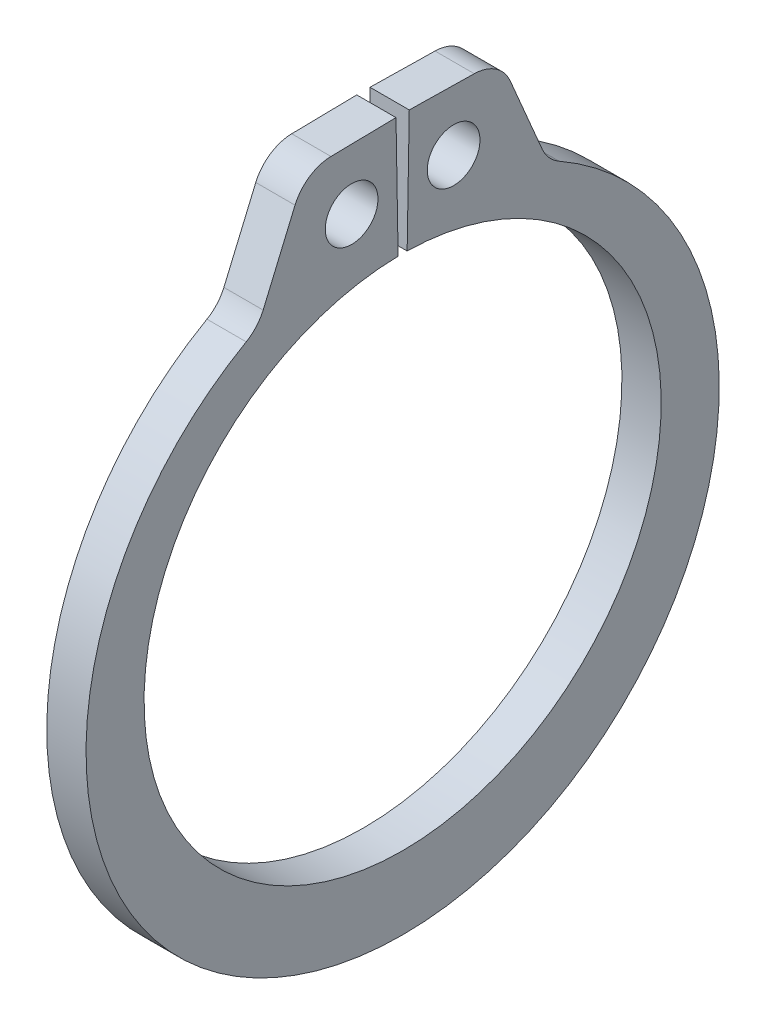
ISO-10303-21;
HEADER;
FILE_DESCRIPTION(('STEP AP214'),'2;1');
FILE_NAME('part.step','',(''),(''),'','','');
FILE_SCHEMA(('AUTOMOTIVE_DESIGN { 1 0 10303 214 1 1 1 1 }'));
ENDSEC;
DATA;
#1=APPLICATION_CONTEXT('core data for automotive mechanical design processes');
#2=APPLICATION_PROTOCOL_DEFINITION('international standard','automotive_design',2000,#1);
#3=PRODUCT_CONTEXT('',#1,'mechanical');
#4=PRODUCT('Part','Part','',(#3));
#5=PRODUCT_RELATED_PRODUCT_CATEGORY('part','',(#4));
#6=PRODUCT_DEFINITION_FORMATION('','',#4);
#7=PRODUCT_DEFINITION_CONTEXT('part definition',#1,'design');
#8=PRODUCT_DEFINITION('design','',#6,#7);
#9=PRODUCT_DEFINITION_SHAPE('','',#8);
#10=(LENGTH_UNIT() NAMED_UNIT(*) SI_UNIT(.MILLI.,.METRE.));
#11=(NAMED_UNIT(*) PLANE_ANGLE_UNIT() SI_UNIT($,.RADIAN.));
#12=(NAMED_UNIT(*) SI_UNIT($,.STERADIAN.) SOLID_ANGLE_UNIT());
#13=UNCERTAINTY_MEASURE_WITH_UNIT(LENGTH_MEASURE(1.E-05),#10,'distance_accuracy_value','');
#14=(GEOMETRIC_REPRESENTATION_CONTEXT(3) GLOBAL_UNCERTAINTY_ASSIGNED_CONTEXT((#13)) GLOBAL_UNIT_ASSIGNED_CONTEXT((#10,
#11,#12)) REPRESENTATION_CONTEXT('',''));
#15=CARTESIAN_POINT('',(0.,0.,0.));
#16=DIRECTION('',(0.,0.,1.));
#17=DIRECTION('',(1.,0.,0.));
#18=AXIS2_PLACEMENT_3D('',#15,#16,#17);
#19=CARTESIAN_POINT('',(-0.4445,0.,0.));
#20=DIRECTION('',(1.,0.,0.));
#21=DIRECTION('',(0.,0.,-1.));
#22=AXIS2_PLACEMENT_3D('',#19,#20,#21);
#23=PLANE('',#22);
#24=CARTESIAN_POINT('',(-0.4445,7.20724610900659,-1.15465964864512));
#25=DIRECTION('',(-1.,0.,0.));
#26=DIRECTION('',(0.,0.,1.));
#27=AXIS2_PLACEMENT_3D('',#24,#25,#26);
#28=CIRCLE('',#27,0.5969);
#29=CARTESIAN_POINT('',(-0.4445,7.20724610900659,-0.557759648645122));
#30=VERTEX_POINT('',#29);
#31=EDGE_CURVE('E177',#30,#30,#28,.F.);
#32=ORIENTED_EDGE('',*,*,#31,.T.);
#33=EDGE_LOOP('',(#32));
#34=FACE_BOUND('',#33,.T.);
#35=CARTESIAN_POINT('',(-0.4445,7.20724610900659,1.15465964864512));
#36=DIRECTION('',(-1.,0.,0.));
#37=DIRECTION('',(0.,0.,1.));
#38=AXIS2_PLACEMENT_3D('',#35,#36,#37);
#39=CIRCLE('',#38,0.5969);
#40=CARTESIAN_POINT('',(-0.4445,7.20724610900659,1.75155964864512));
#41=VERTEX_POINT('',#40);
#42=EDGE_CURVE('E129',#41,#41,#39,.F.);
#43=ORIENTED_EDGE('',*,*,#42,.T.);
#44=EDGE_LOOP('',(#43));
#45=FACE_BOUND('',#44,.T.);
#46=CARTESIAN_POINT('',(-0.4445,7.66933071962559,1.60650376158788));
#47=DIRECTION('',(-1.,0.,0.));
#48=DIRECTION('',(0.,0.,1.));
#49=AXIS2_PLACEMENT_3D('',#46,#47,#48);
#50=CIRCLE('',#49,0.9017);
#51=CARTESIAN_POINT('',(-0.4445,8.57089338634811,1.62224059647239));
#52=VERTEX_POINT('',#51);
#53=CARTESIAN_POINT('',(-0.4445,8.02240621636442,2.43620285379096));
#54=VERTEX_POINT('',#53);
#55=EDGE_CURVE('E20',#52,#54,#50,.F.);
#56=ORIENTED_EDGE('',*,*,#55,.F.);
#57=DIRECTION('',(0.,0.01745240643729,-0.999847695156391));
#58=VECTOR('',#57,1.);
#59=CARTESIAN_POINT('',(-0.4445,8.59659049818515,0.150054045307108));
#60=LINE('',#59,#58);
#61=CARTESIAN_POINT('',(-0.4445,8.59659049818515,0.150054045307118));
#62=VERTEX_POINT('',#61);
#63=EDGE_CURVE('E96',#52,#62,#60,.T.);
#64=ORIENTED_EDGE('',*,*,#63,.T.);
#65=DIRECTION('',(0.,-0.999847695156391,-0.017452406437283));
#66=VECTOR('',#65,1.);
#67=CARTESIAN_POINT('',(-0.4445,5.85380830083212,0.102178603968368));
#68=LINE('',#67,#66);
#69=CARTESIAN_POINT('',(-0.4445,5.85380830083212,0.102178603968368));
#70=VERTEX_POINT('',#69);
#71=EDGE_CURVE('E126',#62,#70,#68,.T.);
#72=ORIENTED_EDGE('',*,*,#71,.T.);
#73=CARTESIAN_POINT('',(-0.4445,0.,0.));
#74=DIRECTION('',(-1.,0.,0.));
#75=DIRECTION('',(0.,0.,1.));
#76=AXIS2_PLACEMENT_3D('',#73,#74,#75);
#77=CIRCLE('',#76,5.8547);
#78=CARTESIAN_POINT('',(-0.4445,5.85380830083213,-0.102178603968368));
#79=VERTEX_POINT('',#78);
#80=EDGE_CURVE('E139',#70,#79,#77,.F.);
#81=ORIENTED_EDGE('',*,*,#80,.T.);
#82=DIRECTION('',(0.,0.999847695156391,-0.017452406437283));
#83=VECTOR('',#82,1.);
#84=CARTESIAN_POINT('',(-0.4445,5.85380830083212,-0.102178603968368));
#85=LINE('',#84,#83);
#86=CARTESIAN_POINT('',(-0.4445,8.59659049818515,-0.150054045307118));
#87=VERTEX_POINT('',#86);
#88=EDGE_CURVE('E136',#79,#87,#85,.T.);
#89=ORIENTED_EDGE('',*,*,#88,.T.);
#90=DIRECTION('',(0.,-0.01745240643729,-0.999847695156391));
#91=VECTOR('',#90,1.);
#92=CARTESIAN_POINT('',(-0.4445,8.59659049818515,-0.150054045307108));
#93=LINE('',#92,#91);
#94=CARTESIAN_POINT('',(-0.4445,8.5708933863481,-1.62224059647239));
#95=VERTEX_POINT('',#94);
#96=EDGE_CURVE('E143',#87,#95,#93,.T.);
#97=ORIENTED_EDGE('',*,*,#96,.T.);
#98=CARTESIAN_POINT('',(-0.4445,7.66933071962559,-1.60650376158788));
#99=DIRECTION('',(-1.,0.,0.));
#100=DIRECTION('',(0.,0.,1.));
#101=AXIS2_PLACEMENT_3D('',#98,#99,#100);
#102=CIRCLE('',#101,0.9017);
#103=CARTESIAN_POINT('',(-0.4445,8.02240621636442,-2.43620285379096));
#104=VERTEX_POINT('',#103);
#105=EDGE_CURVE('E146',#104,#95,#102,.F.);
#106=ORIENTED_EDGE('',*,*,#105,.F.);
#107=DIRECTION('',(0.,-0.920149819455566,-0.391566481910657));
#108=VECTOR('',#107,1.);
#109=CARTESIAN_POINT('',(-0.4445,8.56068391718106,-2.20714069332188));
#110=LINE('',#109,#108);
#111=CARTESIAN_POINT('',(-0.4445,6.32616456625772,-3.15803245301383));
#112=VERTEX_POINT('',#111);
#113=EDGE_CURVE('E149',#104,#112,#110,.T.);
#114=ORIENTED_EDGE('',*,*,#113,.T.);
#115=CARTESIAN_POINT('',(-0.4445,6.67924006299656,-3.98773154521692));
#116=DIRECTION('',(-1.,0.,0.));
#117=DIRECTION('',(0.,0.,1.));
#118=AXIS2_PLACEMENT_3D('',#115,#116,#117);
#119=CIRCLE('',#118,0.9017);
#120=CARTESIAN_POINT('',(-0.4445,5.89530863003733,-3.54218199868086));
#121=VERTEX_POINT('',#120);
#122=EDGE_CURVE('E187',#112,#121,#119,.F.);
#123=ORIENTED_EDGE('',*,*,#122,.T.);
#124=CARTESIAN_POINT('',(-0.4445,-0.337057291142261,0.));
#125=DIRECTION('',(-1.,0.,0.));
#126=DIRECTION('',(0.,0.,1.));
#127=AXIS2_PLACEMENT_3D('',#124,#125,#126);
#128=CIRCLE('',#127,7.16864270885777);
#129=CARTESIAN_POINT('',(-0.4445,5.89530863003733,3.54218199868087));
#130=VERTEX_POINT('',#129);
#131=EDGE_CURVE('E189',#130,#121,#128,.F.);
#132=ORIENTED_EDGE('',*,*,#131,.F.);
#133=CARTESIAN_POINT('',(-0.4445,6.67924006299656,3.98773154521692));
#134=DIRECTION('',(-1.,0.,0.));
#135=DIRECTION('',(0.,0.,1.));
#136=AXIS2_PLACEMENT_3D('',#133,#134,#135);
#137=CIRCLE('',#136,0.9017);
#138=CARTESIAN_POINT('',(-0.4445,6.32616456625773,3.15803245301383));
#139=VERTEX_POINT('',#138);
#140=EDGE_CURVE('E112',#130,#139,#137,.F.);
#141=ORIENTED_EDGE('',*,*,#140,.T.);
#142=DIRECTION('',(0.,0.920149819455566,-0.391566481910657));
#143=VECTOR('',#142,1.);
#144=CARTESIAN_POINT('',(-0.4445,8.56068391718106,2.20714069332188));
#145=LINE('',#144,#143);
#146=EDGE_CURVE('E110',#139,#54,#145,.T.);
#147=ORIENTED_EDGE('',*,*,#146,.T.);
#148=EDGE_LOOP('',(#56,#64,#72,#81,#89,#97,#106,#114,#123,#132,#141,#147));
#149=FACE_BOUND('',#148,.T.);
#150=ADVANCED_FACE('F17',(#34,#45,#149),#23,.F.);
#151=CARTESIAN_POINT('',(0.4445,8.59659049818515,0.150054045307108));
#152=DIRECTION('',(0.,-0.999847695156391,-0.01745240643729));
#153=DIRECTION('',(0.,0.01745240643729,-0.999847695156391));
#154=AXIS2_PLACEMENT_3D('',#151,#152,#153);
#155=PLANE('',#154);
#156=DIRECTION('',(-1.,0.,0.));
#157=VECTOR('',#156,1.);
#158=CARTESIAN_POINT('',(0.4445,8.57089338634811,1.62224059647239));
#159=LINE('',#158,#157);
#160=CARTESIAN_POINT('',(0.4445,8.57089338634811,1.62224059647239));
#161=VERTEX_POINT('',#160);
#162=EDGE_CURVE('E107',#161,#52,#159,.T.);
#163=ORIENTED_EDGE('',*,*,#162,.F.);
#164=DIRECTION('',(0.,-0.0174524064372876,0.999847695156391));
#165=VECTOR('',#164,1.);
#166=CARTESIAN_POINT('',(0.4445,8.59659049818515,0.150054045307108));
#167=LINE('',#166,#165);
#168=CARTESIAN_POINT('',(0.4445,8.59659049818515,0.150054045307113));
#169=VERTEX_POINT('',#168);
#170=EDGE_CURVE('E176',#169,#161,#167,.T.);
#171=ORIENTED_EDGE('',*,*,#170,.F.);
#172=DIRECTION('',(1.,0.,0.));
#173=VECTOR('',#172,1.);
#174=CARTESIAN_POINT('',(0.4445,8.59659049818515,0.150054045307123));
#175=LINE('',#174,#173);
#176=EDGE_CURVE('E130',#169,#62,#175,.F.);
#177=ORIENTED_EDGE('',*,*,#176,.T.);
#178=ORIENTED_EDGE('',*,*,#63,.F.);
#179=EDGE_LOOP('',(#163,#171,#177,#178));
#180=FACE_BOUND('',#179,.T.);
#181=ADVANCED_FACE('F237',(#180),#155,.F.);
#182=CARTESIAN_POINT('',(0.4445,7.66933071962559,1.60650376158788));
#183=DIRECTION('',(-1.,0.,0.));
#184=DIRECTION('',(0.,0.,1.));
#185=AXIS2_PLACEMENT_3D('',#182,#183,#184);
#186=CYLINDRICAL_SURFACE('',#185,0.9017);
#187=ORIENTED_EDGE('',*,*,#55,.T.);
#188=DIRECTION('',(1.,0.,0.));
#189=VECTOR('',#188,1.);
#190=CARTESIAN_POINT('',(0.4445,8.02240621636441,2.43620285379096));
#191=LINE('',#190,#189);
#192=CARTESIAN_POINT('',(0.4445,8.02240621636442,2.43620285379097));
#193=VERTEX_POINT('',#192);
#194=EDGE_CURVE('E105',#54,#193,#191,.T.);
#195=ORIENTED_EDGE('',*,*,#194,.T.);
#196=CARTESIAN_POINT('',(0.4445,7.66933071962559,1.60650376158788));
#197=DIRECTION('',(-1.,0.,0.));
#198=DIRECTION('',(0.,0.,1.));
#199=AXIS2_PLACEMENT_3D('',#196,#197,#198);
#200=CIRCLE('',#199,0.9017);
#201=EDGE_CURVE('E174',#161,#193,#200,.F.);
#202=ORIENTED_EDGE('',*,*,#201,.F.);
#203=ORIENTED_EDGE('',*,*,#162,.T.);
#204=EDGE_LOOP('',(#187,#195,#202,#203));
#205=FACE_BOUND('',#204,.T.);
#206=ADVANCED_FACE('F102',(#205),#186,.T.);
#207=CARTESIAN_POINT('',(0.4445,8.56068391718106,2.20714069332188));
#208=DIRECTION('',(0.,-0.391566481910657,-0.920149819455566));
#209=DIRECTION('',(0.,0.920149819455566,-0.391566481910657));
#210=AXIS2_PLACEMENT_3D('',#207,#208,#209);
#211=PLANE('',#210);
#212=DIRECTION('',(-1.,0.,0.));
#213=VECTOR('',#212,1.);
#214=CARTESIAN_POINT('',(0.4445,6.32616456625773,3.15803245301383));
#215=LINE('',#214,#213);
#216=CARTESIAN_POINT('',(0.4445,6.32616456625773,3.15803245301383));
#217=VERTEX_POINT('',#216);
#218=EDGE_CURVE('E123',#139,#217,#215,.F.);
#219=ORIENTED_EDGE('',*,*,#218,.T.);
#220=DIRECTION('',(0.,-0.920149819455569,0.391566481910651));
#221=VECTOR('',#220,1.);
#222=CARTESIAN_POINT('',(0.4445,8.02240621636442,2.43620285379097));
#223=LINE('',#222,#221);
#224=EDGE_CURVE('E118',#193,#217,#223,.T.);
#225=ORIENTED_EDGE('',*,*,#224,.F.);
#226=ORIENTED_EDGE('',*,*,#194,.F.);
#227=ORIENTED_EDGE('',*,*,#146,.F.);
#228=EDGE_LOOP('',(#219,#225,#226,#227));
#229=FACE_BOUND('',#228,.T.);
#230=ADVANCED_FACE('F116',(#229),#211,.F.);
#231=CARTESIAN_POINT('',(0.4445,6.67924006299656,3.98773154521692));
#232=DIRECTION('',(-1.,0.,0.));
#233=DIRECTION('',(0.,0.,1.));
#234=AXIS2_PLACEMENT_3D('',#231,#232,#233);
#235=CYLINDRICAL_SURFACE('',#234,0.9017);
#236=ORIENTED_EDGE('',*,*,#218,.F.);
#237=ORIENTED_EDGE('',*,*,#140,.F.);
#238=DIRECTION('',(-1.,0.,0.));
#239=VECTOR('',#238,1.);
#240=CARTESIAN_POINT('',(0.4445,5.89530863003734,3.54218199868086));
#241=LINE('',#240,#239);
#242=CARTESIAN_POINT('',(0.4445,5.89530863003734,3.54218199868087));
#243=VERTEX_POINT('',#242);
#244=EDGE_CURVE('E191',#243,#130,#241,.T.);
#245=ORIENTED_EDGE('',*,*,#244,.F.);
#246=CARTESIAN_POINT('',(0.4445,6.67924006299656,3.98773154521692));
#247=DIRECTION('',(-1.,0.,0.));
#248=DIRECTION('',(0.,0.,1.));
#249=AXIS2_PLACEMENT_3D('',#246,#247,#248);
#250=CIRCLE('',#249,0.9017);
#251=EDGE_CURVE('E171',#217,#243,#250,.T.);
#252=ORIENTED_EDGE('',*,*,#251,.F.);
#253=EDGE_LOOP('',(#236,#237,#245,#252));
#254=FACE_BOUND('',#253,.T.);
#255=ADVANCED_FACE('F302',(#254),#235,.F.);
#256=CARTESIAN_POINT('',(0.4445,-0.337057291142261,0.));
#257=DIRECTION('',(-1.,0.,0.));
#258=DIRECTION('',(0.,0.,1.));
#259=AXIS2_PLACEMENT_3D('',#256,#257,#258);
#260=CYLINDRICAL_SURFACE('',#259,7.16864270885777);
#261=ORIENTED_EDGE('',*,*,#131,.T.);
#262=DIRECTION('',(-1.,0.,0.));
#263=VECTOR('',#262,1.);
#264=CARTESIAN_POINT('',(0.4445,5.89530863003733,-3.54218199868086));
#265=LINE('',#264,#263);
#266=CARTESIAN_POINT('',(0.4445,5.89530863003733,-3.54218199868086));
#267=VERTEX_POINT('',#266);
#268=EDGE_CURVE('E151',#121,#267,#265,.F.);
#269=ORIENTED_EDGE('',*,*,#268,.T.);
#270=CARTESIAN_POINT('',(0.4445,-0.337057291142261,0.));
#271=DIRECTION('',(-1.,0.,0.));
#272=DIRECTION('',(0.,0.,1.));
#273=AXIS2_PLACEMENT_3D('',#270,#271,#272);
#274=CIRCLE('',#273,7.16864270885777);
#275=EDGE_CURVE('E168',#243,#267,#274,.F.);
#276=ORIENTED_EDGE('',*,*,#275,.F.);
#277=ORIENTED_EDGE('',*,*,#244,.T.);
#278=EDGE_LOOP('',(#261,#269,#276,#277));
#279=FACE_BOUND('',#278,.T.);
#280=ADVANCED_FACE('F305',(#279),#260,.T.);
#281=CARTESIAN_POINT('',(0.4445,6.67924006299656,-3.98773154521692));
#282=DIRECTION('',(-1.,0.,0.));
#283=DIRECTION('',(0.,0.,1.));
#284=AXIS2_PLACEMENT_3D('',#281,#282,#283);
#285=CYLINDRICAL_SURFACE('',#284,0.9017);
#286=ORIENTED_EDGE('',*,*,#268,.F.);
#287=ORIENTED_EDGE('',*,*,#122,.F.);
#288=DIRECTION('',(1.,0.,0.));
#289=VECTOR('',#288,1.);
#290=CARTESIAN_POINT('',(0.4445,6.32616456625773,-3.15803245301382));
#291=LINE('',#290,#289);
#292=CARTESIAN_POINT('',(0.4445,6.32616456625773,-3.15803245301383));
#293=VERTEX_POINT('',#292);
#294=EDGE_CURVE('E150',#112,#293,#291,.T.);
#295=ORIENTED_EDGE('',*,*,#294,.T.);
#296=CARTESIAN_POINT('',(0.4445,6.67924006299656,-3.98773154521692));
#297=DIRECTION('',(-1.,0.,0.));
#298=DIRECTION('',(0.,0.,1.));
#299=AXIS2_PLACEMENT_3D('',#296,#297,#298);
#300=CIRCLE('',#299,0.9017);
#301=EDGE_CURVE('E165',#267,#293,#300,.T.);
#302=ORIENTED_EDGE('',*,*,#301,.F.);
#303=EDGE_LOOP('',(#286,#287,#295,#302));
#304=FACE_BOUND('',#303,.T.);
#305=ADVANCED_FACE('F309',(#304),#285,.F.);
#306=CARTESIAN_POINT('',(0.4445,8.56068391718106,-2.20714069332188));
#307=DIRECTION('',(0.,-0.391566481910657,0.920149819455566));
#308=DIRECTION('',(0.,-0.920149819455566,-0.391566481910657));
#309=AXIS2_PLACEMENT_3D('',#306,#307,#308);
#310=PLANE('',#309);
#311=ORIENTED_EDGE('',*,*,#294,.F.);
#312=ORIENTED_EDGE('',*,*,#113,.F.);
#313=DIRECTION('',(-1.,0.,0.));
#314=VECTOR('',#313,1.);
#315=CARTESIAN_POINT('',(0.4445,8.02240621636442,-2.43620285379097));
#316=LINE('',#315,#314);
#317=CARTESIAN_POINT('',(0.4445,8.02240621636442,-2.43620285379097));
#318=VERTEX_POINT('',#317);
#319=EDGE_CURVE('E186',#318,#104,#316,.T.);
#320=ORIENTED_EDGE('',*,*,#319,.F.);
#321=DIRECTION('',(0.,0.920149819455569,0.391566481910651));
#322=VECTOR('',#321,1.);
#323=CARTESIAN_POINT('',(0.4445,6.32616456625773,-3.15803245301383));
#324=LINE('',#323,#322);
#325=EDGE_CURVE('E164',#293,#318,#324,.T.);
#326=ORIENTED_EDGE('',*,*,#325,.F.);
#327=EDGE_LOOP('',(#311,#312,#320,#326));
#328=FACE_BOUND('',#327,.T.);
#329=ADVANCED_FACE('F312',(#328),#310,.F.);
#330=CARTESIAN_POINT('',(0.4445,7.66933071962559,-1.60650376158788));
#331=DIRECTION('',(-1.,0.,0.));
#332=DIRECTION('',(0.,0.,1.));
#333=AXIS2_PLACEMENT_3D('',#330,#331,#332);
#334=CYLINDRICAL_SURFACE('',#333,0.9017);
#335=ORIENTED_EDGE('',*,*,#105,.T.);
#336=DIRECTION('',(1.,0.,0.));
#337=VECTOR('',#336,1.);
#338=CARTESIAN_POINT('',(0.4445,8.5708933863481,-1.62224059647239));
#339=LINE('',#338,#337);
#340=CARTESIAN_POINT('',(0.4445,8.57089338634811,-1.62224059647239));
#341=VERTEX_POINT('',#340);
#342=EDGE_CURVE('E145',#95,#341,#339,.T.);
#343=ORIENTED_EDGE('',*,*,#342,.T.);
#344=CARTESIAN_POINT('',(0.4445,7.66933071962559,-1.60650376158788));
#345=DIRECTION('',(-1.,0.,0.));
#346=DIRECTION('',(0.,0.,1.));
#347=AXIS2_PLACEMENT_3D('',#344,#345,#346);
#348=CIRCLE('',#347,0.9017);
#349=EDGE_CURVE('E160',#318,#341,#348,.F.);
#350=ORIENTED_EDGE('',*,*,#349,.F.);
#351=ORIENTED_EDGE('',*,*,#319,.T.);
#352=EDGE_LOOP('',(#335,#343,#350,#351));
#353=FACE_BOUND('',#352,.T.);
#354=ADVANCED_FACE('F254',(#353),#334,.T.);
#355=CARTESIAN_POINT('',(0.4445,8.59659049818515,-0.150054045307108));
#356=DIRECTION('',(0.,-0.999847695156391,0.01745240643729));
#357=DIRECTION('',(0.,-0.01745240643729,-0.999847695156391));
#358=AXIS2_PLACEMENT_3D('',#355,#356,#357);
#359=PLANE('',#358);
#360=ORIENTED_EDGE('',*,*,#342,.F.);
#361=ORIENTED_EDGE('',*,*,#96,.F.);
#362=DIRECTION('',(1.,0.,0.));
#363=VECTOR('',#362,1.);
#364=CARTESIAN_POINT('',(0.4445,8.59659049818515,-0.150054045307123));
#365=LINE('',#364,#363);
#366=CARTESIAN_POINT('',(0.4445,8.59659049818515,-0.150054045307113));
#367=VERTEX_POINT('',#366);
#368=EDGE_CURVE('E140',#87,#367,#365,.T.);
#369=ORIENTED_EDGE('',*,*,#368,.T.);
#370=DIRECTION('',(0.,0.0174524064372876,0.999847695156391));
#371=VECTOR('',#370,1.);
#372=CARTESIAN_POINT('',(0.4445,8.57089338634811,-1.62224059647239));
#373=LINE('',#372,#371);
#374=EDGE_CURVE('E163',#341,#367,#373,.T.);
#375=ORIENTED_EDGE('',*,*,#374,.F.);
#376=EDGE_LOOP('',(#360,#361,#369,#375));
#377=FACE_BOUND('',#376,.T.);
#378=ADVANCED_FACE('F246',(#377),#359,.F.);
#379=CARTESIAN_POINT('',(0.4445,5.85380830083212,-0.102178603968368));
#380=DIRECTION('',(0.,-0.017452406437283,-0.999847695156391));
#381=DIRECTION('',(0.,0.999847695156391,-0.017452406437283));
#382=AXIS2_PLACEMENT_3D('',#379,#380,#381);
#383=PLANE('',#382);
#384=DIRECTION('',(-1.,0.,0.));
#385=VECTOR('',#384,1.);
#386=CARTESIAN_POINT('',(0.4445,5.85380830083213,-0.102178603968367));
#387=LINE('',#386,#385);
#388=CARTESIAN_POINT('',(0.4445,5.85380830083213,-0.102178603968368));
#389=VERTEX_POINT('',#388);
#390=EDGE_CURVE('E183',#79,#389,#387,.F.);
#391=ORIENTED_EDGE('',*,*,#390,.T.);
#392=DIRECTION('',(0.,-0.999847695156391,0.0174524064372776));
#393=VECTOR('',#392,1.);
#394=CARTESIAN_POINT('',(0.4445,8.59659049818515,-0.150054045307108));
#395=LINE('',#394,#393);
#396=EDGE_CURVE('E159',#367,#389,#395,.T.);
#397=ORIENTED_EDGE('',*,*,#396,.F.);
#398=ORIENTED_EDGE('',*,*,#368,.F.);
#399=ORIENTED_EDGE('',*,*,#88,.F.);
#400=EDGE_LOOP('',(#391,#397,#398,#399));
#401=FACE_BOUND('',#400,.T.);
#402=ADVANCED_FACE('F249',(#401),#383,.F.);
#403=CARTESIAN_POINT('',(0.4445,0.,0.));
#404=DIRECTION('',(-1.,0.,0.));
#405=DIRECTION('',(0.,0.,1.));
#406=AXIS2_PLACEMENT_3D('',#403,#404,#405);
#407=CYLINDRICAL_SURFACE('',#406,5.8547);
#408=ORIENTED_EDGE('',*,*,#390,.F.);
#409=ORIENTED_EDGE('',*,*,#80,.F.);
#410=DIRECTION('',(1.,0.,0.));
#411=VECTOR('',#410,1.);
#412=CARTESIAN_POINT('',(0.4445,5.85380830083212,0.102178603968368));
#413=LINE('',#412,#411);
#414=CARTESIAN_POINT('',(0.4445,5.85380830083212,0.102178603968368));
#415=VERTEX_POINT('',#414);
#416=EDGE_CURVE('E35',#70,#415,#413,.T.);
#417=ORIENTED_EDGE('',*,*,#416,.T.);
#418=CARTESIAN_POINT('',(0.4445,0.,0.));
#419=DIRECTION('',(-1.,0.,0.));
#420=DIRECTION('',(0.,0.,1.));
#421=AXIS2_PLACEMENT_3D('',#418,#419,#420);
#422=CIRCLE('',#421,5.8547);
#423=EDGE_CURVE('E156',#389,#415,#422,.T.);
#424=ORIENTED_EDGE('',*,*,#423,.F.);
#425=EDGE_LOOP('',(#408,#409,#417,#424));
#426=FACE_BOUND('',#425,.T.);
#427=ADVANCED_FACE('F257',(#426),#407,.F.);
#428=CARTESIAN_POINT('',(0.4445,5.85380830083212,0.102178603968368));
#429=DIRECTION('',(0.,-0.017452406437283,0.999847695156391));
#430=DIRECTION('',(0.,-0.999847695156391,-0.017452406437283));
#431=AXIS2_PLACEMENT_3D('',#428,#429,#430);
#432=PLANE('',#431);
#433=ORIENTED_EDGE('',*,*,#176,.F.);
#434=DIRECTION('',(0.,0.999847695156391,0.0174524064372776));
#435=VECTOR('',#434,1.);
#436=CARTESIAN_POINT('',(0.4445,5.85380830083212,0.102178603968368));
#437=LINE('',#436,#435);
#438=EDGE_CURVE('E155',#415,#169,#437,.T.);
#439=ORIENTED_EDGE('',*,*,#438,.F.);
#440=ORIENTED_EDGE('',*,*,#416,.F.);
#441=ORIENTED_EDGE('',*,*,#71,.F.);
#442=EDGE_LOOP('',(#433,#439,#440,#441));
#443=FACE_BOUND('',#442,.T.);
#444=ADVANCED_FACE('F235',(#443),#432,.F.);
#445=CARTESIAN_POINT('',(0.4445,7.20724610900659,1.15465964864512));
#446=DIRECTION('',(-1.,0.,0.));
#447=DIRECTION('',(0.,0.,1.));
#448=AXIS2_PLACEMENT_3D('',#445,#446,#447);
#449=CYLINDRICAL_SURFACE('',#448,0.5969);
#450=ORIENTED_EDGE('',*,*,#42,.F.);
#451=EDGE_LOOP('',(#450));
#452=FACE_BOUND('',#451,.T.);
#453=CARTESIAN_POINT('',(0.4445,7.20724610900659,1.15465964864512));
#454=DIRECTION('',(-1.,0.,0.));
#455=DIRECTION('',(0.,0.,1.));
#456=AXIS2_PLACEMENT_3D('',#453,#454,#455);
#457=CIRCLE('',#456,0.5969);
#458=CARTESIAN_POINT('',(0.4445,7.20724610900659,1.75155964864512));
#459=VERTEX_POINT('',#458);
#460=EDGE_CURVE('E26',#459,#459,#457,.T.);
#461=ORIENTED_EDGE('',*,*,#460,.F.);
#462=EDGE_LOOP('',(#461));
#463=FACE_BOUND('',#462,.T.);
#464=ADVANCED_FACE('F265',(#452,#463),#449,.F.);
#465=CARTESIAN_POINT('',(0.4445,7.20724610900659,-1.15465964864512));
#466=DIRECTION('',(-1.,0.,0.));
#467=DIRECTION('',(0.,0.,1.));
#468=AXIS2_PLACEMENT_3D('',#465,#466,#467);
#469=CYLINDRICAL_SURFACE('',#468,0.5969);
#470=ORIENTED_EDGE('',*,*,#31,.F.);
#471=EDGE_LOOP('',(#470));
#472=FACE_BOUND('',#471,.T.);
#473=CARTESIAN_POINT('',(0.4445,7.20724610900659,-1.15465964864512));
#474=DIRECTION('',(-1.,0.,0.));
#475=DIRECTION('',(0.,0.,1.));
#476=AXIS2_PLACEMENT_3D('',#473,#474,#475);
#477=CIRCLE('',#476,0.5969);
#478=CARTESIAN_POINT('',(0.4445,7.20724610900659,-0.557759648645122));
#479=VERTEX_POINT('',#478);
#480=EDGE_CURVE('E11',#479,#479,#477,.T.);
#481=ORIENTED_EDGE('',*,*,#480,.F.);
#482=EDGE_LOOP('',(#481));
#483=FACE_BOUND('',#482,.T.);
#484=ADVANCED_FACE('F269',(#472,#483),#469,.F.);
#485=CARTESIAN_POINT('',(0.4445,0.,0.));
#486=DIRECTION('',(1.,0.,0.));
#487=DIRECTION('',(0.,0.,-1.));
#488=AXIS2_PLACEMENT_3D('',#485,#486,#487);
#489=PLANE('',#488);
#490=ORIENTED_EDGE('',*,*,#480,.T.);
#491=EDGE_LOOP('',(#490));
#492=FACE_BOUND('',#491,.T.);
#493=ORIENTED_EDGE('',*,*,#460,.T.);
#494=EDGE_LOOP('',(#493));
#495=FACE_BOUND('',#494,.T.);
#496=ORIENTED_EDGE('',*,*,#423,.T.);
#497=ORIENTED_EDGE('',*,*,#438,.T.);
#498=ORIENTED_EDGE('',*,*,#170,.T.);
#499=ORIENTED_EDGE('',*,*,#201,.T.);
#500=ORIENTED_EDGE('',*,*,#224,.T.);
#501=ORIENTED_EDGE('',*,*,#251,.T.);
#502=ORIENTED_EDGE('',*,*,#275,.T.);
#503=ORIENTED_EDGE('',*,*,#301,.T.);
#504=ORIENTED_EDGE('',*,*,#325,.T.);
#505=ORIENTED_EDGE('',*,*,#349,.T.);
#506=ORIENTED_EDGE('',*,*,#374,.T.);
#507=ORIENTED_EDGE('',*,*,#396,.T.);
#508=EDGE_LOOP('',(#496,#497,#498,#499,#500,#501,#502,#503,#504,#505,#506,#507));
#509=FACE_BOUND('',#508,.T.);
#510=ADVANCED_FACE('F230',(#492,#495,#509),#489,.T.);
#511=CLOSED_SHELL('',(#150,#181,#206,#230,#255,#280,#305,#329,#354,#378,#402,#427,#444,#464,
#484,#510));
#512=MANIFOLD_SOLID_BREP('B1',#511);
#513=ADVANCED_BREP_SHAPE_REPRESENTATION('',(#18,#512),#14);
#514=SHAPE_DEFINITION_REPRESENTATION(#9,#513);
ENDSEC;
END-ISO-10303-21;
